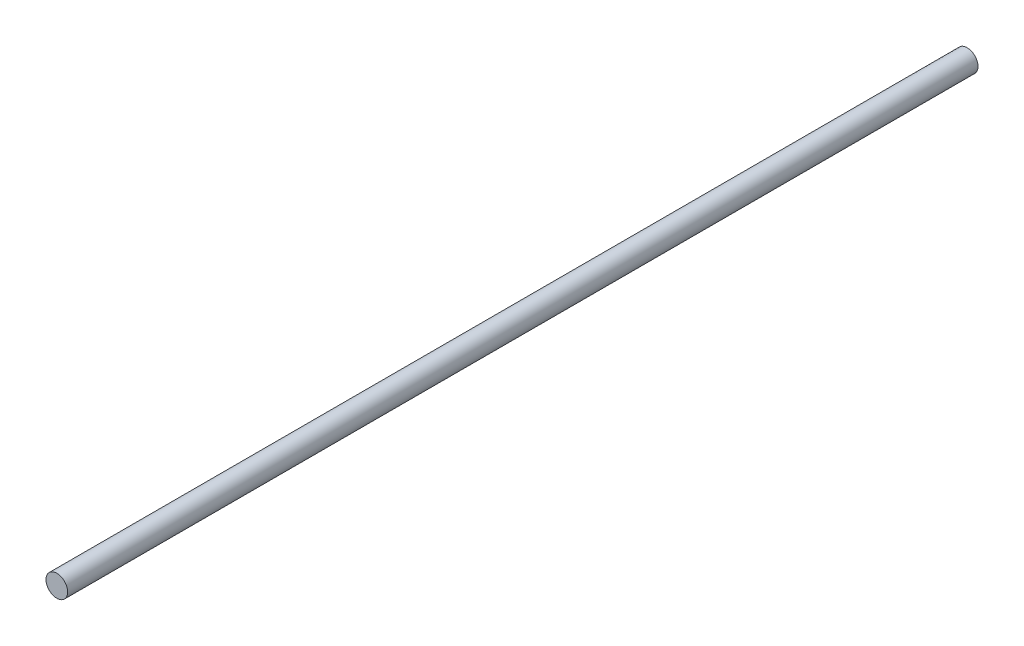
ISO-10303-21;
HEADER;
FILE_DESCRIPTION(('STEP AP214'),'2;1');
FILE_NAME('part.step','',(''),(''),'','','');
FILE_SCHEMA(('AUTOMOTIVE_DESIGN { 1 0 10303 214 1 1 1 1 }'));
ENDSEC;
DATA;
#1=APPLICATION_CONTEXT('core data for automotive mechanical design processes');
#2=APPLICATION_PROTOCOL_DEFINITION('international standard','automotive_design',2000,#1);
#3=PRODUCT_CONTEXT('',#1,'mechanical');
#4=PRODUCT('Part','Part','',(#3));
#5=PRODUCT_RELATED_PRODUCT_CATEGORY('part','',(#4));
#6=PRODUCT_DEFINITION_FORMATION('','',#4);
#7=PRODUCT_DEFINITION_CONTEXT('part definition',#1,'design');
#8=PRODUCT_DEFINITION('design','',#6,#7);
#9=PRODUCT_DEFINITION_SHAPE('','',#8);
#10=(LENGTH_UNIT() NAMED_UNIT(*) SI_UNIT(.MILLI.,.METRE.));
#11=(NAMED_UNIT(*) PLANE_ANGLE_UNIT() SI_UNIT($,.RADIAN.));
#12=(NAMED_UNIT(*) SI_UNIT($,.STERADIAN.) SOLID_ANGLE_UNIT());
#13=UNCERTAINTY_MEASURE_WITH_UNIT(LENGTH_MEASURE(1.E-05),#10,'distance_accuracy_value','');
#14=(GEOMETRIC_REPRESENTATION_CONTEXT(3) GLOBAL_UNCERTAINTY_ASSIGNED_CONTEXT((#13)) GLOBAL_UNIT_ASSIGNED_CONTEXT((#10,
#11,#12)) REPRESENTATION_CONTEXT('',''));
#15=CARTESIAN_POINT('',(0.,0.,0.));
#16=DIRECTION('',(0.,0.,1.));
#17=DIRECTION('',(1.,0.,0.));
#18=AXIS2_PLACEMENT_3D('',#15,#16,#17);
#19=CARTESIAN_POINT('',(0.,0.,133.35));
#20=DIRECTION('',(0.,0.,-1.));
#21=DIRECTION('',(-1.,0.,0.));
#22=AXIS2_PLACEMENT_3D('',#19,#20,#21);
#23=CYLINDRICAL_SURFACE('',#22,3.175);
#24=CARTESIAN_POINT('',(0.,0.,133.35));
#25=DIRECTION('',(0.,0.,1.));
#26=DIRECTION('',(1.,0.,0.));
#27=AXIS2_PLACEMENT_3D('',#24,#25,#26);
#28=CIRCLE('',#27,3.175);
#29=CARTESIAN_POINT('',(3.175,0.,133.35));
#30=VERTEX_POINT('',#29);
#31=EDGE_CURVE('E10',#30,#30,#28,.T.);
#32=ORIENTED_EDGE('',*,*,#31,.F.);
#33=EDGE_LOOP('',(#32));
#34=FACE_BOUND('',#33,.T.);
#35=CARTESIAN_POINT('',(0.,0.,-133.35));
#36=DIRECTION('',(0.,0.,1.));
#37=DIRECTION('',(1.,0.,0.));
#38=AXIS2_PLACEMENT_3D('',#35,#36,#37);
#39=CIRCLE('',#38,3.175);
#40=CARTESIAN_POINT('',(3.175,0.,-133.35));
#41=VERTEX_POINT('',#40);
#42=EDGE_CURVE('E44',#41,#41,#39,.T.);
#43=ORIENTED_EDGE('',*,*,#42,.T.);
#44=EDGE_LOOP('',(#43));
#45=FACE_BOUND('',#44,.T.);
#46=ADVANCED_FACE('F41',(#34,#45),#23,.T.);
#47=CARTESIAN_POINT('',(0.,0.,133.35));
#48=DIRECTION('',(0.,0.,1.));
#49=DIRECTION('',(1.,0.,0.));
#50=AXIS2_PLACEMENT_3D('',#47,#48,#49);
#51=PLANE('',#50);
#52=ORIENTED_EDGE('',*,*,#31,.T.);
#53=EDGE_LOOP('',(#52));
#54=FACE_BOUND('',#53,.T.);
#55=ADVANCED_FACE('F58',(#54),#51,.T.);
#56=CARTESIAN_POINT('',(0.,0.,-133.35));
#57=DIRECTION('',(0.,0.,1.));
#58=DIRECTION('',(1.,0.,0.));
#59=AXIS2_PLACEMENT_3D('',#56,#57,#58);
#60=PLANE('',#59);
#61=ORIENTED_EDGE('',*,*,#42,.F.);
#62=EDGE_LOOP('',(#61));
#63=FACE_BOUND('',#62,.T.);
#64=ADVANCED_FACE('F56',(#63),#60,.F.);
#65=CLOSED_SHELL('',(#46,#55,#64));
#66=MANIFOLD_SOLID_BREP('B2',#65);
#67=ADVANCED_BREP_SHAPE_REPRESENTATION('',(#18,#66),#14);
#68=SHAPE_DEFINITION_REPRESENTATION(#9,#67);
ENDSEC;
END-ISO-10303-21;
